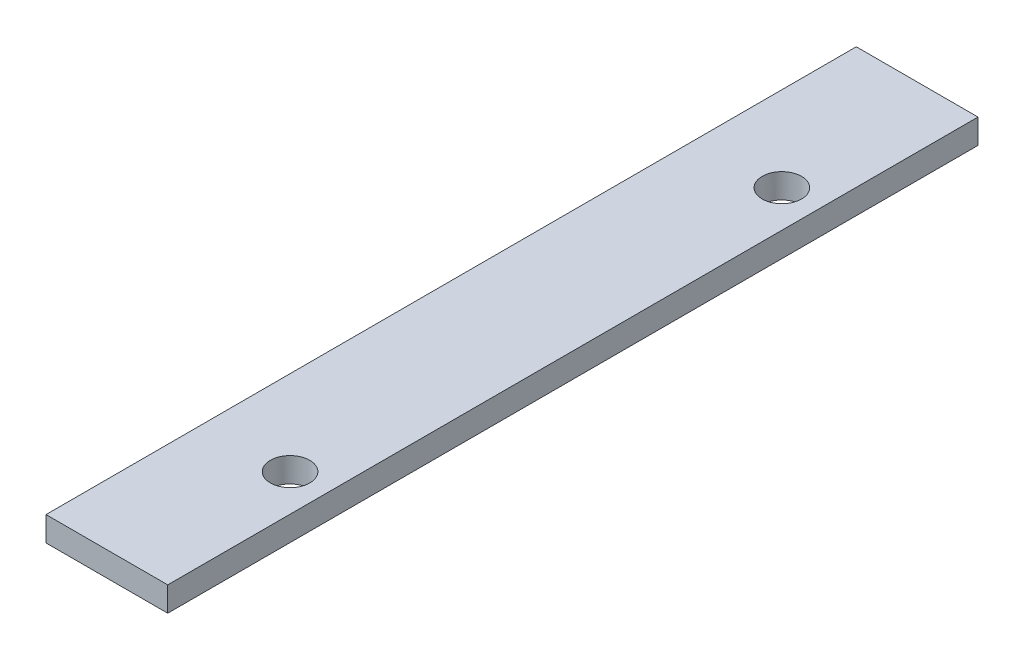
ISO-10303-21;
HEADER;
FILE_DESCRIPTION(('STEP AP214'),'2;1');
FILE_NAME('part.step','',(''),(''),'','','');
FILE_SCHEMA(('AUTOMOTIVE_DESIGN { 1 0 10303 214 1 1 1 1 }'));
ENDSEC;
DATA;
#1=APPLICATION_CONTEXT('core data for automotive mechanical design processes');
#2=APPLICATION_PROTOCOL_DEFINITION('international standard','automotive_design',2000,#1);
#3=PRODUCT_CONTEXT('',#1,'mechanical');
#4=PRODUCT('Part','Part','',(#3));
#5=PRODUCT_RELATED_PRODUCT_CATEGORY('part','',(#4));
#6=PRODUCT_DEFINITION_FORMATION('','',#4);
#7=PRODUCT_DEFINITION_CONTEXT('part definition',#1,'design');
#8=PRODUCT_DEFINITION('design','',#6,#7);
#9=PRODUCT_DEFINITION_SHAPE('','',#8);
#10=(LENGTH_UNIT() NAMED_UNIT(*) SI_UNIT(.MILLI.,.METRE.));
#11=(NAMED_UNIT(*) PLANE_ANGLE_UNIT() SI_UNIT($,.RADIAN.));
#12=(NAMED_UNIT(*) SI_UNIT($,.STERADIAN.) SOLID_ANGLE_UNIT());
#13=UNCERTAINTY_MEASURE_WITH_UNIT(LENGTH_MEASURE(1.E-05),#10,'distance_accuracy_value','');
#14=(GEOMETRIC_REPRESENTATION_CONTEXT(3) GLOBAL_UNCERTAINTY_ASSIGNED_CONTEXT((#13)) GLOBAL_UNIT_ASSIGNED_CONTEXT((#10,
#11,#12)) REPRESENTATION_CONTEXT('',''));
#15=CARTESIAN_POINT('',(0.,0.,0.));
#16=DIRECTION('',(0.,0.,1.));
#17=DIRECTION('',(1.,0.,0.));
#18=AXIS2_PLACEMENT_3D('',#15,#16,#17);
#19=CARTESIAN_POINT('',(-4.95,2.,-32.95));
#20=DIRECTION('',(1.,0.,0.));
#21=DIRECTION('',(0.,0.,-1.));
#22=AXIS2_PLACEMENT_3D('',#19,#20,#21);
#23=PLANE('',#22);
#24=DIRECTION('',(0.,0.,1.));
#25=VECTOR('',#24,1.);
#26=CARTESIAN_POINT('',(-4.95,0.,-32.95));
#27=LINE('',#26,#25);
#28=CARTESIAN_POINT('',(-4.95,0.,-32.95));
#29=VERTEX_POINT('',#28);
#30=CARTESIAN_POINT('',(-4.95,0.,32.95));
#31=VERTEX_POINT('',#30);
#32=EDGE_CURVE('E107',#29,#31,#27,.T.);
#33=ORIENTED_EDGE('',*,*,#32,.T.);
#34=DIRECTION('',(0.,-1.,0.));
#35=VECTOR('',#34,1.);
#36=CARTESIAN_POINT('',(-4.95,2.,32.95));
#37=LINE('',#36,#35);
#38=CARTESIAN_POINT('',(-4.95,2.,32.95));
#39=VERTEX_POINT('',#38);
#40=EDGE_CURVE('E11',#39,#31,#37,.T.);
#41=ORIENTED_EDGE('',*,*,#40,.F.);
#42=DIRECTION('',(0.,0.,1.));
#43=VECTOR('',#42,1.);
#44=CARTESIAN_POINT('',(-4.95,2.,-32.95));
#45=LINE('',#44,#43);
#46=CARTESIAN_POINT('',(-4.95,2.,-32.95));
#47=VERTEX_POINT('',#46);
#48=EDGE_CURVE('E91',#47,#39,#45,.T.);
#49=ORIENTED_EDGE('',*,*,#48,.F.);
#50=DIRECTION('',(0.,-1.,0.));
#51=VECTOR('',#50,1.);
#52=CARTESIAN_POINT('',(-4.95,2.,-32.95));
#53=LINE('',#52,#51);
#54=EDGE_CURVE('E103',#47,#29,#53,.T.);
#55=ORIENTED_EDGE('',*,*,#54,.T.);
#56=EDGE_LOOP('',(#33,#41,#49,#55));
#57=FACE_BOUND('',#56,.T.);
#58=ADVANCED_FACE('F39',(#57),#23,.F.);
#59=CARTESIAN_POINT('',(4.95000000000001,2.,32.95));
#60=DIRECTION('',(0.,0.,-1.));
#61=DIRECTION('',(-1.,0.,0.));
#62=AXIS2_PLACEMENT_3D('',#59,#60,#61);
#63=PLANE('',#62);
#64=DIRECTION('',(1.,0.,0.));
#65=VECTOR('',#64,1.);
#66=CARTESIAN_POINT('',(4.95000000000001,0.,32.95));
#67=LINE('',#66,#65);
#68=CARTESIAN_POINT('',(4.95000000000001,0.,32.95));
#69=VERTEX_POINT('',#68);
#70=EDGE_CURVE('E96',#31,#69,#67,.T.);
#71=ORIENTED_EDGE('',*,*,#70,.T.);
#72=DIRECTION('',(0.,-1.,0.));
#73=VECTOR('',#72,1.);
#74=CARTESIAN_POINT('',(4.95000000000001,2.,32.95));
#75=LINE('',#74,#73);
#76=CARTESIAN_POINT('',(4.95000000000001,2.,32.95));
#77=VERTEX_POINT('',#76);
#78=EDGE_CURVE('E48',#77,#69,#75,.T.);
#79=ORIENTED_EDGE('',*,*,#78,.F.);
#80=DIRECTION('',(1.,0.,0.));
#81=VECTOR('',#80,1.);
#82=CARTESIAN_POINT('',(4.95000000000001,2.,32.95));
#83=LINE('',#82,#81);
#84=EDGE_CURVE('E86',#39,#77,#83,.T.);
#85=ORIENTED_EDGE('',*,*,#84,.F.);
#86=ORIENTED_EDGE('',*,*,#40,.T.);
#87=EDGE_LOOP('',(#71,#79,#85,#86));
#88=FACE_BOUND('',#87,.T.);
#89=ADVANCED_FACE('F95',(#88),#63,.F.);
#90=CARTESIAN_POINT('',(4.95,2.,-32.95));
#91=DIRECTION('',(-1.,0.,0.));
#92=DIRECTION('',(0.,0.,1.));
#93=AXIS2_PLACEMENT_3D('',#90,#91,#92);
#94=PLANE('',#93);
#95=DIRECTION('',(0.,0.,-1.));
#96=VECTOR('',#95,1.);
#97=CARTESIAN_POINT('',(4.95,0.,-32.95));
#98=LINE('',#97,#96);
#99=CARTESIAN_POINT('',(4.95,0.,-32.95));
#100=VERTEX_POINT('',#99);
#101=EDGE_CURVE('E73',#69,#100,#98,.T.);
#102=ORIENTED_EDGE('',*,*,#101,.T.);
#103=DIRECTION('',(0.,-1.,0.));
#104=VECTOR('',#103,1.);
#105=CARTESIAN_POINT('',(4.95,2.,-32.95));
#106=LINE('',#105,#104);
#107=CARTESIAN_POINT('',(4.95,2.,-32.95));
#108=VERTEX_POINT('',#107);
#109=EDGE_CURVE('E98',#108,#100,#106,.T.);
#110=ORIENTED_EDGE('',*,*,#109,.F.);
#111=DIRECTION('',(0.,0.,-1.));
#112=VECTOR('',#111,1.);
#113=CARTESIAN_POINT('',(4.95,2.,-32.95));
#114=LINE('',#113,#112);
#115=EDGE_CURVE('E89',#77,#108,#114,.T.);
#116=ORIENTED_EDGE('',*,*,#115,.F.);
#117=ORIENTED_EDGE('',*,*,#78,.T.);
#118=EDGE_LOOP('',(#102,#110,#116,#117));
#119=FACE_BOUND('',#118,.T.);
#120=ADVANCED_FACE('F99',(#119),#94,.F.);
#121=CARTESIAN_POINT('',(4.95,2.,-32.95));
#122=DIRECTION('',(0.,0.,1.));
#123=DIRECTION('',(1.,0.,0.));
#124=AXIS2_PLACEMENT_3D('',#121,#122,#123);
#125=PLANE('',#124);
#126=DIRECTION('',(-1.,0.,0.));
#127=VECTOR('',#126,1.);
#128=CARTESIAN_POINT('',(4.95,0.,-32.95));
#129=LINE('',#128,#127);
#130=EDGE_CURVE('E79',#100,#29,#129,.T.);
#131=ORIENTED_EDGE('',*,*,#130,.T.);
#132=ORIENTED_EDGE('',*,*,#54,.F.);
#133=DIRECTION('',(-1.,0.,0.));
#134=VECTOR('',#133,1.);
#135=CARTESIAN_POINT('',(4.95,2.,-32.95));
#136=LINE('',#135,#134);
#137=EDGE_CURVE('E56',#108,#47,#136,.T.);
#138=ORIENTED_EDGE('',*,*,#137,.F.);
#139=ORIENTED_EDGE('',*,*,#109,.T.);
#140=EDGE_LOOP('',(#131,#132,#138,#139));
#141=FACE_BOUND('',#140,.T.);
#142=ADVANCED_FACE('F121',(#141),#125,.F.);
#143=CARTESIAN_POINT('',(0.,2.,0.));
#144=DIRECTION('',(0.,-1.,0.));
#145=DIRECTION('',(0.,0.,-1.));
#146=AXIS2_PLACEMENT_3D('',#143,#144,#145);
#147=PLANE('',#146);
#148=CARTESIAN_POINT('',(1.95,2.,-20.));
#149=DIRECTION('',(0.,-1.,0.));
#150=DIRECTION('',(0.,0.,-1.));
#151=AXIS2_PLACEMENT_3D('',#148,#149,#150);
#152=CIRCLE('',#151,1.6);
#153=CARTESIAN_POINT('',(1.95,2.,-21.6));
#154=VERTEX_POINT('',#153);
#155=EDGE_CURVE('E111',#154,#154,#152,.T.);
#156=ORIENTED_EDGE('',*,*,#155,.T.);
#157=EDGE_LOOP('',(#156));
#158=FACE_BOUND('',#157,.T.);
#159=CARTESIAN_POINT('',(1.95000000000001,2.,20.));
#160=DIRECTION('',(0.,-1.,0.));
#161=DIRECTION('',(0.,0.,-1.));
#162=AXIS2_PLACEMENT_3D('',#159,#160,#161);
#163=CIRCLE('',#162,1.6);
#164=CARTESIAN_POINT('',(1.95000000000001,2.,18.4));
#165=VERTEX_POINT('',#164);
#166=EDGE_CURVE('E131',#165,#165,#163,.T.);
#167=ORIENTED_EDGE('',*,*,#166,.T.);
#168=EDGE_LOOP('',(#167));
#169=FACE_BOUND('',#168,.T.);
#170=ORIENTED_EDGE('',*,*,#48,.T.);
#171=ORIENTED_EDGE('',*,*,#84,.T.);
#172=ORIENTED_EDGE('',*,*,#115,.T.);
#173=ORIENTED_EDGE('',*,*,#137,.T.);
#174=EDGE_LOOP('',(#170,#171,#172,#173));
#175=FACE_BOUND('',#174,.T.);
#176=ADVANCED_FACE('F87',(#158,#169,#175),#147,.F.);
#177=CARTESIAN_POINT('',(0.,0.,0.));
#178=DIRECTION('',(0.,-1.,0.));
#179=DIRECTION('',(0.,0.,-1.));
#180=AXIS2_PLACEMENT_3D('',#177,#178,#179);
#181=PLANE('',#180);
#182=CARTESIAN_POINT('',(1.95,0.,-20.));
#183=DIRECTION('',(0.,1.,0.));
#184=DIRECTION('',(0.,0.,1.));
#185=AXIS2_PLACEMENT_3D('',#182,#183,#184);
#186=CIRCLE('',#185,1.6);
#187=CARTESIAN_POINT('',(1.95,0.,-18.4));
#188=VERTEX_POINT('',#187);
#189=EDGE_CURVE('E135',#188,#188,#186,.T.);
#190=ORIENTED_EDGE('',*,*,#189,.T.);
#191=EDGE_LOOP('',(#190));
#192=FACE_BOUND('',#191,.T.);
#193=CARTESIAN_POINT('',(1.95000000000001,0.,20.));
#194=DIRECTION('',(0.,1.,0.));
#195=DIRECTION('',(0.,0.,1.));
#196=AXIS2_PLACEMENT_3D('',#193,#194,#195);
#197=CIRCLE('',#196,1.6);
#198=CARTESIAN_POINT('',(1.95000000000001,0.,21.6));
#199=VERTEX_POINT('',#198);
#200=EDGE_CURVE('E136',#199,#199,#197,.T.);
#201=ORIENTED_EDGE('',*,*,#200,.T.);
#202=EDGE_LOOP('',(#201));
#203=FACE_BOUND('',#202,.T.);
#204=ORIENTED_EDGE('',*,*,#32,.F.);
#205=ORIENTED_EDGE('',*,*,#130,.F.);
#206=ORIENTED_EDGE('',*,*,#101,.F.);
#207=ORIENTED_EDGE('',*,*,#70,.F.);
#208=EDGE_LOOP('',(#204,#205,#206,#207));
#209=FACE_BOUND('',#208,.T.);
#210=ADVANCED_FACE('F124',(#192,#203,#209),#181,.T.);
#211=CARTESIAN_POINT('',(1.95000000000001,0.,20.));
#212=DIRECTION('',(0.,1.,0.));
#213=DIRECTION('',(0.,0.,1.));
#214=AXIS2_PLACEMENT_3D('',#211,#212,#213);
#215=CYLINDRICAL_SURFACE('',#214,1.6);
#216=ORIENTED_EDGE('',*,*,#200,.F.);
#217=EDGE_LOOP('',(#216));
#218=FACE_BOUND('',#217,.T.);
#219=ORIENTED_EDGE('',*,*,#166,.F.);
#220=EDGE_LOOP('',(#219));
#221=FACE_BOUND('',#220,.T.);
#222=ADVANCED_FACE('F149',(#218,#221),#215,.F.);
#223=CARTESIAN_POINT('',(1.95,0.,-20.));
#224=DIRECTION('',(0.,1.,0.));
#225=DIRECTION('',(0.,0.,1.));
#226=AXIS2_PLACEMENT_3D('',#223,#224,#225);
#227=CYLINDRICAL_SURFACE('',#226,1.6);
#228=ORIENTED_EDGE('',*,*,#189,.F.);
#229=EDGE_LOOP('',(#228));
#230=FACE_BOUND('',#229,.T.);
#231=ORIENTED_EDGE('',*,*,#155,.F.);
#232=EDGE_LOOP('',(#231));
#233=FACE_BOUND('',#232,.T.);
#234=ADVANCED_FACE('F146',(#230,#233),#227,.F.);
#235=CLOSED_SHELL('',(#58,#89,#120,#142,#176,#210,#222,#234));
#236=MANIFOLD_SOLID_BREP('B2',#235);
#237=ADVANCED_BREP_SHAPE_REPRESENTATION('',(#18,#236),#14);
#238=SHAPE_DEFINITION_REPRESENTATION(#9,#237);
ENDSEC;
END-ISO-10303-21;
